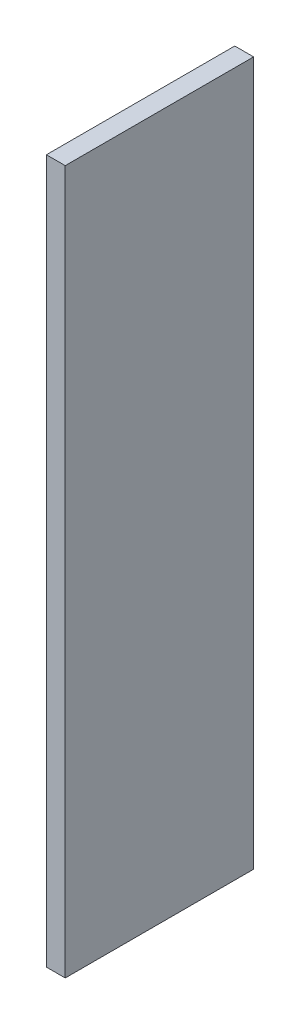
ISO-10303-21;
HEADER;
FILE_DESCRIPTION(('STEP AP214'),'2;1');
FILE_NAME('part.step','',(''),(''),'','','');
FILE_SCHEMA(('AUTOMOTIVE_DESIGN { 1 0 10303 214 1 1 1 1 }'));
ENDSEC;
DATA;
#1=APPLICATION_CONTEXT('core data for automotive mechanical design processes');
#2=APPLICATION_PROTOCOL_DEFINITION('international standard','automotive_design',2000,#1);
#3=PRODUCT_CONTEXT('',#1,'mechanical');
#4=PRODUCT('Part','Part','',(#3));
#5=PRODUCT_RELATED_PRODUCT_CATEGORY('part','',(#4));
#6=PRODUCT_DEFINITION_FORMATION('','',#4);
#7=PRODUCT_DEFINITION_CONTEXT('part definition',#1,'design');
#8=PRODUCT_DEFINITION('design','',#6,#7);
#9=PRODUCT_DEFINITION_SHAPE('','',#8);
#10=(LENGTH_UNIT() NAMED_UNIT(*) SI_UNIT(.MILLI.,.METRE.));
#11=(NAMED_UNIT(*) PLANE_ANGLE_UNIT() SI_UNIT($,.RADIAN.));
#12=(NAMED_UNIT(*) SI_UNIT($,.STERADIAN.) SOLID_ANGLE_UNIT());
#13=UNCERTAINTY_MEASURE_WITH_UNIT(LENGTH_MEASURE(1.E-05),#10,'distance_accuracy_value','');
#14=(GEOMETRIC_REPRESENTATION_CONTEXT(3) GLOBAL_UNCERTAINTY_ASSIGNED_CONTEXT((#13)) GLOBAL_UNIT_ASSIGNED_CONTEXT((#10,
#11,#12)) REPRESENTATION_CONTEXT('',''));
#15=CARTESIAN_POINT('',(0.,0.,0.));
#16=DIRECTION('',(0.,0.,1.));
#17=DIRECTION('',(1.,0.,0.));
#18=AXIS2_PLACEMENT_3D('',#15,#16,#17);
#19=CARTESIAN_POINT('',(2.54,0.,0.));
#20=DIRECTION('',(0.,0.,-1.));
#21=DIRECTION('',(-1.,0.,0.));
#22=AXIS2_PLACEMENT_3D('',#19,#20,#21);
#23=PLANE('',#22);
#24=DIRECTION('',(0.,-1.,0.));
#25=VECTOR('',#24,1.);
#26=CARTESIAN_POINT('',(0.,0.,0.));
#27=LINE('',#26,#25);
#28=CARTESIAN_POINT('',(0.,94.869,0.));
#29=VERTEX_POINT('',#28);
#30=CARTESIAN_POINT('',(0.,0.,0.));
#31=VERTEX_POINT('',#30);
#32=EDGE_CURVE('E96',#29,#31,#27,.T.);
#33=ORIENTED_EDGE('',*,*,#32,.T.);
#34=DIRECTION('',(-1.,0.,0.));
#35=VECTOR('',#34,1.);
#36=CARTESIAN_POINT('',(2.54,0.,0.));
#37=LINE('',#36,#35);
#38=CARTESIAN_POINT('',(2.54,0.,0.));
#39=VERTEX_POINT('',#38);
#40=EDGE_CURVE('E11',#39,#31,#37,.T.);
#41=ORIENTED_EDGE('',*,*,#40,.F.);
#42=DIRECTION('',(0.,-1.,0.));
#43=VECTOR('',#42,1.);
#44=CARTESIAN_POINT('',(2.54,0.,0.));
#45=LINE('',#44,#43);
#46=CARTESIAN_POINT('',(2.54,94.869,0.));
#47=VERTEX_POINT('',#46);
#48=EDGE_CURVE('E84',#47,#39,#45,.T.);
#49=ORIENTED_EDGE('',*,*,#48,.F.);
#50=DIRECTION('',(-1.,0.,0.));
#51=VECTOR('',#50,1.);
#52=CARTESIAN_POINT('',(2.54,94.869,0.));
#53=LINE('',#52,#51);
#54=EDGE_CURVE('E92',#47,#29,#53,.T.);
#55=ORIENTED_EDGE('',*,*,#54,.T.);
#56=EDGE_LOOP('',(#33,#41,#49,#55));
#57=FACE_BOUND('',#56,.T.);
#58=ADVANCED_FACE('F33',(#57),#23,.F.);
#59=CARTESIAN_POINT('',(2.54,0.,0.));
#60=DIRECTION('',(0.,1.,0.));
#61=DIRECTION('',(0.,0.,1.));
#62=AXIS2_PLACEMENT_3D('',#59,#60,#61);
#63=PLANE('',#62);
#64=DIRECTION('',(0.,0.,-1.));
#65=VECTOR('',#64,1.);
#66=CARTESIAN_POINT('',(0.,0.,0.));
#67=LINE('',#66,#65);
#68=CARTESIAN_POINT('',(0.,0.,-25.4));
#69=VERTEX_POINT('',#68);
#70=EDGE_CURVE('E88',#31,#69,#67,.T.);
#71=ORIENTED_EDGE('',*,*,#70,.T.);
#72=DIRECTION('',(-1.,0.,0.));
#73=VECTOR('',#72,1.);
#74=CARTESIAN_POINT('',(2.54,0.,-25.4));
#75=LINE('',#74,#73);
#76=CARTESIAN_POINT('',(2.54,0.,-25.4));
#77=VERTEX_POINT('',#76);
#78=EDGE_CURVE('E41',#77,#69,#75,.T.);
#79=ORIENTED_EDGE('',*,*,#78,.F.);
#80=DIRECTION('',(0.,0.,-1.));
#81=VECTOR('',#80,1.);
#82=CARTESIAN_POINT('',(2.54,0.,0.));
#83=LINE('',#82,#81);
#84=EDGE_CURVE('E79',#39,#77,#83,.T.);
#85=ORIENTED_EDGE('',*,*,#84,.F.);
#86=ORIENTED_EDGE('',*,*,#40,.T.);
#87=EDGE_LOOP('',(#71,#79,#85,#86));
#88=FACE_BOUND('',#87,.T.);
#89=ADVANCED_FACE('F87',(#88),#63,.F.);
#90=CARTESIAN_POINT('',(2.54,0.,-25.4));
#91=DIRECTION('',(0.,0.,1.));
#92=DIRECTION('',(1.,0.,0.));
#93=AXIS2_PLACEMENT_3D('',#90,#91,#92);
#94=PLANE('',#93);
#95=DIRECTION('',(0.,1.,0.));
#96=VECTOR('',#95,1.);
#97=CARTESIAN_POINT('',(0.,0.,-25.4));
#98=LINE('',#97,#96);
#99=CARTESIAN_POINT('',(0.,94.869,-25.4));
#100=VERTEX_POINT('',#99);
#101=EDGE_CURVE('E66',#69,#100,#98,.T.);
#102=ORIENTED_EDGE('',*,*,#101,.T.);
#103=DIRECTION('',(-1.,0.,0.));
#104=VECTOR('',#103,1.);
#105=CARTESIAN_POINT('',(2.54,94.869,-25.4));
#106=LINE('',#105,#104);
#107=CARTESIAN_POINT('',(2.54,94.869,-25.4));
#108=VERTEX_POINT('',#107);
#109=EDGE_CURVE('E89',#108,#100,#106,.T.);
#110=ORIENTED_EDGE('',*,*,#109,.F.);
#111=DIRECTION('',(0.,1.,0.));
#112=VECTOR('',#111,1.);
#113=CARTESIAN_POINT('',(2.54,0.,-25.4));
#114=LINE('',#113,#112);
#115=EDGE_CURVE('E82',#77,#108,#114,.T.);
#116=ORIENTED_EDGE('',*,*,#115,.F.);
#117=ORIENTED_EDGE('',*,*,#78,.T.);
#118=EDGE_LOOP('',(#102,#110,#116,#117));
#119=FACE_BOUND('',#118,.T.);
#120=ADVANCED_FACE('F90',(#119),#94,.F.);
#121=CARTESIAN_POINT('',(2.54,94.869,0.));
#122=DIRECTION('',(0.,-1.,0.));
#123=DIRECTION('',(0.,0.,-1.));
#124=AXIS2_PLACEMENT_3D('',#121,#122,#123);
#125=PLANE('',#124);
#126=DIRECTION('',(0.,0.,1.));
#127=VECTOR('',#126,1.);
#128=CARTESIAN_POINT('',(0.,94.869,0.));
#129=LINE('',#128,#127);
#130=EDGE_CURVE('E72',#100,#29,#129,.T.);
#131=ORIENTED_EDGE('',*,*,#130,.T.);
#132=ORIENTED_EDGE('',*,*,#54,.F.);
#133=DIRECTION('',(0.,0.,1.));
#134=VECTOR('',#133,1.);
#135=CARTESIAN_POINT('',(2.54,94.869,0.));
#136=LINE('',#135,#134);
#137=EDGE_CURVE('E49',#108,#47,#136,.T.);
#138=ORIENTED_EDGE('',*,*,#137,.F.);
#139=ORIENTED_EDGE('',*,*,#109,.T.);
#140=EDGE_LOOP('',(#131,#132,#138,#139));
#141=FACE_BOUND('',#140,.T.);
#142=ADVANCED_FACE('F103',(#141),#125,.F.);
#143=CARTESIAN_POINT('',(2.54,0.,0.));
#144=DIRECTION('',(-1.,0.,0.));
#145=DIRECTION('',(0.,0.,1.));
#146=AXIS2_PLACEMENT_3D('',#143,#144,#145);
#147=PLANE('',#146);
#148=ORIENTED_EDGE('',*,*,#48,.T.);
#149=ORIENTED_EDGE('',*,*,#84,.T.);
#150=ORIENTED_EDGE('',*,*,#115,.T.);
#151=ORIENTED_EDGE('',*,*,#137,.T.);
#152=EDGE_LOOP('',(#148,#149,#150,#151));
#153=FACE_BOUND('',#152,.T.);
#154=ADVANCED_FACE('F80',(#153),#147,.F.);
#155=CARTESIAN_POINT('',(0.,0.,0.));
#156=DIRECTION('',(-1.,0.,0.));
#157=DIRECTION('',(0.,0.,1.));
#158=AXIS2_PLACEMENT_3D('',#155,#156,#157);
#159=PLANE('',#158);
#160=ORIENTED_EDGE('',*,*,#32,.F.);
#161=ORIENTED_EDGE('',*,*,#130,.F.);
#162=ORIENTED_EDGE('',*,*,#101,.F.);
#163=ORIENTED_EDGE('',*,*,#70,.F.);
#164=EDGE_LOOP('',(#160,#161,#162,#163));
#165=FACE_BOUND('',#164,.T.);
#166=ADVANCED_FACE('F106',(#165),#159,.T.);
#167=CLOSED_SHELL('',(#58,#89,#120,#142,#154,#166));
#168=MANIFOLD_SOLID_BREP('B2',#167);
#169=ADVANCED_BREP_SHAPE_REPRESENTATION('',(#18,#168),#14);
#170=SHAPE_DEFINITION_REPRESENTATION(#9,#169);
ENDSEC;
END-ISO-10303-21;
